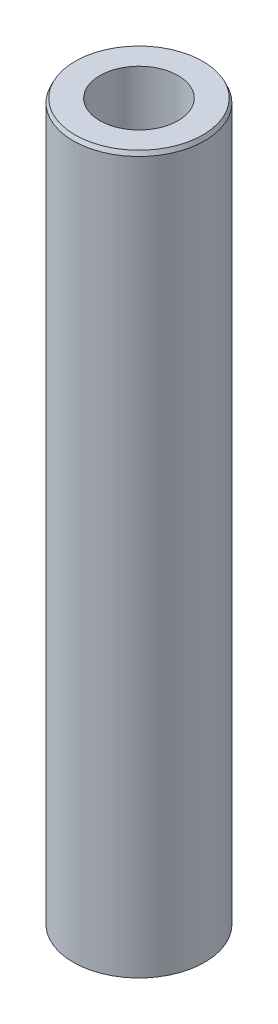
ISO-10303-21;
HEADER;
FILE_DESCRIPTION(('STEP AP214'),'2;1');
FILE_NAME('part.step','',(''),(''),'','','');
FILE_SCHEMA(('AUTOMOTIVE_DESIGN { 1 0 10303 214 1 1 1 1 }'));
ENDSEC;
DATA;
#1=APPLICATION_CONTEXT('core data for automotive mechanical design processes');
#2=APPLICATION_PROTOCOL_DEFINITION('international standard','automotive_design',2000,#1);
#3=PRODUCT_CONTEXT('',#1,'mechanical');
#4=PRODUCT('Part','Part','',(#3));
#5=PRODUCT_RELATED_PRODUCT_CATEGORY('part','',(#4));
#6=PRODUCT_DEFINITION_FORMATION('','',#4);
#7=PRODUCT_DEFINITION_CONTEXT('part definition',#1,'design');
#8=PRODUCT_DEFINITION('design','',#6,#7);
#9=PRODUCT_DEFINITION_SHAPE('','',#8);
#10=(LENGTH_UNIT() NAMED_UNIT(*) SI_UNIT(.MILLI.,.METRE.));
#11=(NAMED_UNIT(*) PLANE_ANGLE_UNIT() SI_UNIT($,.RADIAN.));
#12=(NAMED_UNIT(*) SI_UNIT($,.STERADIAN.) SOLID_ANGLE_UNIT());
#13=UNCERTAINTY_MEASURE_WITH_UNIT(LENGTH_MEASURE(1.E-05),#10,'distance_accuracy_value','');
#14=(GEOMETRIC_REPRESENTATION_CONTEXT(3) GLOBAL_UNCERTAINTY_ASSIGNED_CONTEXT((#13)) GLOBAL_UNIT_ASSIGNED_CONTEXT((#10,
#11,#12)) REPRESENTATION_CONTEXT('',''));
#15=CARTESIAN_POINT('',(0.,0.,0.));
#16=DIRECTION('',(0.,0.,1.));
#17=DIRECTION('',(1.,0.,0.));
#18=AXIS2_PLACEMENT_3D('',#15,#16,#17);
#19=CARTESIAN_POINT('',(0.,600.,0.));
#20=DIRECTION('',(0.,-1.,0.));
#21=DIRECTION('',(0.,0.,-1.));
#22=AXIS2_PLACEMENT_3D('',#19,#20,#21);
#23=CYLINDRICAL_SURFACE('',#22,55.);
#24=CARTESIAN_POINT('',(0.,596.58330676156,0.));
#25=DIRECTION('',(0.,1.,0.));
#26=DIRECTION('',(0.,0.,1.));
#27=AXIS2_PLACEMENT_3D('',#24,#25,#26);
#28=CIRCLE('',#27,55.);
#29=CARTESIAN_POINT('',(0.,596.58330676156,55.));
#30=VERTEX_POINT('',#29);
#31=EDGE_CURVE('E50',#30,#30,#28,.F.);
#32=ORIENTED_EDGE('',*,*,#31,.T.);
#33=EDGE_LOOP('',(#32));
#34=FACE_BOUND('',#33,.T.);
#35=CARTESIAN_POINT('',(0.,1.60626815494458,0.));
#36=DIRECTION('',(0.,1.,0.));
#37=DIRECTION('',(0.,0.,1.));
#38=AXIS2_PLACEMENT_3D('',#35,#36,#37);
#39=CIRCLE('',#38,55.);
#40=CARTESIAN_POINT('',(0.,1.60626815494458,55.));
#41=VERTEX_POINT('',#40);
#42=EDGE_CURVE('E51',#41,#41,#39,.T.);
#43=ORIENTED_EDGE('',*,*,#42,.T.);
#44=EDGE_LOOP('',(#43));
#45=FACE_BOUND('',#44,.T.);
#46=ADVANCED_FACE('F39',(#34,#45),#23,.T.);
#47=CARTESIAN_POINT('',(0.,600.,0.));
#48=DIRECTION('',(0.,1.,0.));
#49=DIRECTION('',(0.,0.,1.));
#50=AXIS2_PLACEMENT_3D('',#47,#48,#49);
#51=PLANE('',#50);
#52=CARTESIAN_POINT('',(0.,600.,0.));
#53=DIRECTION('',(0.,1.,0.));
#54=DIRECTION('',(0.,0.,1.));
#55=AXIS2_PLACEMENT_3D('',#52,#53,#54);
#56=CIRCLE('',#55,53.3937318450552);
#57=CARTESIAN_POINT('',(0.,600.,53.3937318450552));
#58=VERTEX_POINT('',#57);
#59=EDGE_CURVE('E54',#58,#58,#56,.T.);
#60=ORIENTED_EDGE('',*,*,#59,.T.);
#61=EDGE_LOOP('',(#60));
#62=FACE_BOUND('',#61,.T.);
#63=CARTESIAN_POINT('',(0.,600.,0.));
#64=DIRECTION('',(0.,1.,0.));
#65=DIRECTION('',(0.,0.,1.));
#66=AXIS2_PLACEMENT_3D('',#63,#64,#65);
#67=CIRCLE('',#66,32.7203140247522);
#68=CARTESIAN_POINT('',(0.,600.,32.7203140247522));
#69=VERTEX_POINT('',#68);
#70=EDGE_CURVE('E58',#69,#69,#67,.T.);
#71=ORIENTED_EDGE('',*,*,#70,.F.);
#72=EDGE_LOOP('',(#71));
#73=FACE_BOUND('',#72,.T.);
#74=ADVANCED_FACE('F69',(#62,#73),#51,.T.);
#75=CARTESIAN_POINT('',(0.,0.,0.));
#76=DIRECTION('',(0.,1.,0.));
#77=DIRECTION('',(0.,0.,1.));
#78=AXIS2_PLACEMENT_3D('',#75,#76,#77);
#79=PLANE('',#78);
#80=CARTESIAN_POINT('',(0.,0.,0.));
#81=DIRECTION('',(0.,1.,0.));
#82=DIRECTION('',(0.,0.,1.));
#83=AXIS2_PLACEMENT_3D('',#80,#81,#82);
#84=CIRCLE('',#83,51.58330676156);
#85=CARTESIAN_POINT('',(0.,0.,51.58330676156));
#86=VERTEX_POINT('',#85);
#87=EDGE_CURVE('E10',#86,#86,#84,.F.);
#88=ORIENTED_EDGE('',*,*,#87,.T.);
#89=EDGE_LOOP('',(#88));
#90=FACE_BOUND('',#89,.T.);
#91=CARTESIAN_POINT('',(0.,0.,0.));
#92=DIRECTION('',(0.,1.,0.));
#93=DIRECTION('',(0.,0.,1.));
#94=AXIS2_PLACEMENT_3D('',#91,#92,#93);
#95=CIRCLE('',#94,32.7203140247522);
#96=CARTESIAN_POINT('',(0.,0.,32.7203140247522));
#97=VERTEX_POINT('',#96);
#98=EDGE_CURVE('E63',#97,#97,#95,.T.);
#99=ORIENTED_EDGE('',*,*,#98,.T.);
#100=EDGE_LOOP('',(#99));
#101=FACE_BOUND('',#100,.T.);
#102=ADVANCED_FACE('F75',(#90,#101),#79,.F.);
#103=CARTESIAN_POINT('',(0.,600.,0.));
#104=DIRECTION('',(0.,-1.,0.));
#105=DIRECTION('',(0.,0.,-1.));
#106=AXIS2_PLACEMENT_3D('',#103,#104,#105);
#107=CYLINDRICAL_SURFACE('',#106,32.7203140247522);
#108=ORIENTED_EDGE('',*,*,#70,.T.);
#109=EDGE_LOOP('',(#108));
#110=FACE_BOUND('',#109,.T.);
#111=ORIENTED_EDGE('',*,*,#98,.F.);
#112=EDGE_LOOP('',(#111));
#113=FACE_BOUND('',#112,.T.);
#114=ADVANCED_FACE('F70',(#110,#113),#107,.F.);
#115=CARTESIAN_POINT('',(0.,600.,0.));
#116=DIRECTION('',(0.,-1.,0.));
#117=DIRECTION('',(0.,0.,-1.));
#118=AXIS2_PLACEMENT_3D('',#115,#116,#117);
#119=CONICAL_SURFACE('',#118,53.3937318450552,0.439462126353674);
#120=ORIENTED_EDGE('',*,*,#31,.F.);
#121=EDGE_LOOP('',(#120));
#122=FACE_BOUND('',#121,.T.);
#123=ORIENTED_EDGE('',*,*,#59,.F.);
#124=EDGE_LOOP('',(#123));
#125=FACE_BOUND('',#124,.T.);
#126=ADVANCED_FACE('F81',(#122,#125),#119,.T.);
#127=CARTESIAN_POINT('',(0.,1.60626815494458,0.));
#128=DIRECTION('',(0.,1.,0.));
#129=DIRECTION('',(0.,0.,1.));
#130=AXIS2_PLACEMENT_3D('',#127,#128,#129);
#131=CONICAL_SURFACE('',#130,55.,1.13133420044123);
#132=ORIENTED_EDGE('',*,*,#87,.F.);
#133=EDGE_LOOP('',(#132));
#134=FACE_BOUND('',#133,.T.);
#135=ORIENTED_EDGE('',*,*,#42,.F.);
#136=EDGE_LOOP('',(#135));
#137=FACE_BOUND('',#136,.T.);
#138=ADVANCED_FACE('F45',(#134,#137),#131,.T.);
#139=CLOSED_SHELL('',(#46,#74,#102,#114,#126,#138));
#140=MANIFOLD_SOLID_BREP('B2',#139);
#141=ADVANCED_BREP_SHAPE_REPRESENTATION('',(#18,#140),#14);
#142=SHAPE_DEFINITION_REPRESENTATION(#9,#141);
ENDSEC;
END-ISO-10303-21;
